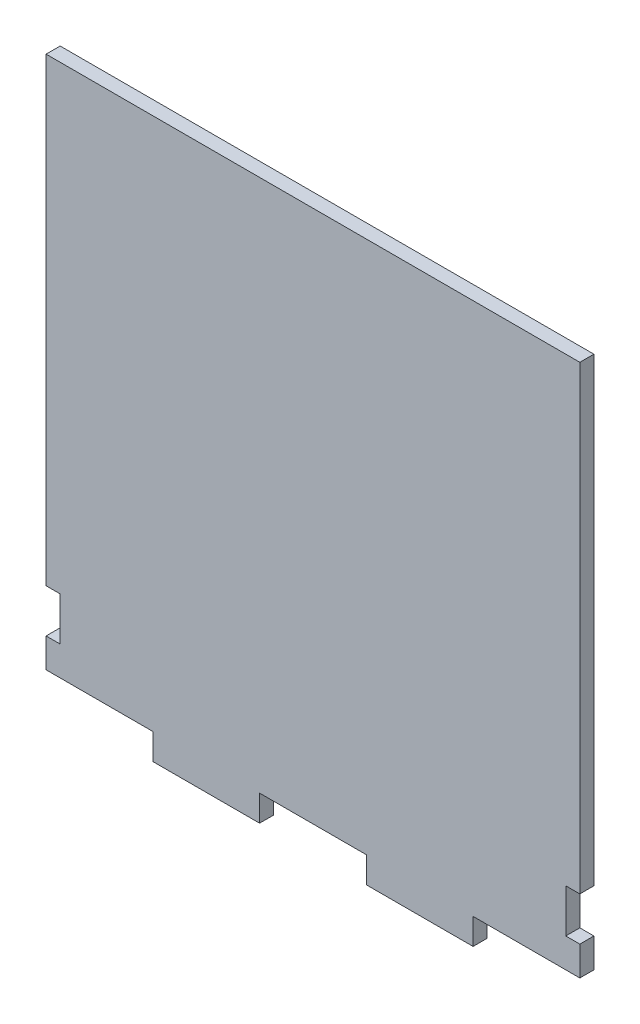
ISO-10303-21;
HEADER;
FILE_DESCRIPTION(('STEP AP214'),'2;1');
FILE_NAME('part.step','',(''),(''),'','','');
FILE_SCHEMA(('AUTOMOTIVE_DESIGN { 1 0 10303 214 1 1 1 1 }'));
ENDSEC;
DATA;
#1=APPLICATION_CONTEXT('core data for automotive mechanical design processes');
#2=APPLICATION_PROTOCOL_DEFINITION('international standard','automotive_design',2000,#1);
#3=PRODUCT_CONTEXT('',#1,'mechanical');
#4=PRODUCT('Part','Part','',(#3));
#5=PRODUCT_RELATED_PRODUCT_CATEGORY('part','',(#4));
#6=PRODUCT_DEFINITION_FORMATION('','',#4);
#7=PRODUCT_DEFINITION_CONTEXT('part definition',#1,'design');
#8=PRODUCT_DEFINITION('design','',#6,#7);
#9=PRODUCT_DEFINITION_SHAPE('','',#8);
#10=(LENGTH_UNIT() NAMED_UNIT(*) SI_UNIT(.MILLI.,.METRE.));
#11=(NAMED_UNIT(*) PLANE_ANGLE_UNIT() SI_UNIT($,.RADIAN.));
#12=(NAMED_UNIT(*) SI_UNIT($,.STERADIAN.) SOLID_ANGLE_UNIT());
#13=UNCERTAINTY_MEASURE_WITH_UNIT(LENGTH_MEASURE(1.E-05),#10,'distance_accuracy_value','');
#14=(GEOMETRIC_REPRESENTATION_CONTEXT(3) GLOBAL_UNCERTAINTY_ASSIGNED_CONTEXT((#13)) GLOBAL_UNIT_ASSIGNED_CONTEXT((#10,
#11,#12)) REPRESENTATION_CONTEXT('',''));
#15=CARTESIAN_POINT('',(0.,0.,0.));
#16=DIRECTION('',(0.,0.,1.));
#17=DIRECTION('',(1.,0.,0.));
#18=AXIS2_PLACEMENT_3D('',#15,#16,#17);
#19=CARTESIAN_POINT('',(10.24,-14.8,2.7));
#20=DIRECTION('',(0.,1.,0.));
#21=DIRECTION('',(0.,0.,1.));
#22=AXIS2_PLACEMENT_3D('',#19,#20,#21);
#23=PLANE('',#22);
#24=DIRECTION('',(1.,0.,0.));
#25=VECTOR('',#24,1.);
#26=CARTESIAN_POINT('',(10.24,-14.8,0.));
#27=LINE('',#26,#25);
#28=CARTESIAN_POINT('',(10.24,-14.8,0.));
#29=VERTEX_POINT('',#28);
#30=CARTESIAN_POINT('',(30.72,-14.8,0.));
#31=VERTEX_POINT('',#30);
#32=EDGE_CURVE('E201',#29,#31,#27,.T.);
#33=ORIENTED_EDGE('',*,*,#32,.T.);
#34=DIRECTION('',(0.,0.,-1.));
#35=VECTOR('',#34,1.);
#36=CARTESIAN_POINT('',(30.72,-14.8,2.7));
#37=LINE('',#36,#35);
#38=CARTESIAN_POINT('',(30.72,-14.8,2.7));
#39=VERTEX_POINT('',#38);
#40=EDGE_CURVE('E11',#39,#31,#37,.T.);
#41=ORIENTED_EDGE('',*,*,#40,.F.);
#42=DIRECTION('',(1.,0.,0.));
#43=VECTOR('',#42,1.);
#44=CARTESIAN_POINT('',(10.24,-14.8,2.7));
#45=LINE('',#44,#43);
#46=CARTESIAN_POINT('',(10.24,-14.8,2.7));
#47=VERTEX_POINT('',#46);
#48=EDGE_CURVE('E242',#47,#39,#45,.T.);
#49=ORIENTED_EDGE('',*,*,#48,.F.);
#50=DIRECTION('',(0.,0.,-1.));
#51=VECTOR('',#50,1.);
#52=CARTESIAN_POINT('',(10.24,-14.8,2.7));
#53=LINE('',#52,#51);
#54=EDGE_CURVE('E197',#47,#29,#53,.T.);
#55=ORIENTED_EDGE('',*,*,#54,.T.);
#56=EDGE_LOOP('',(#33,#41,#49,#55));
#57=FACE_BOUND('',#56,.T.);
#58=ADVANCED_FACE('F33',(#57),#23,.F.);
#59=CARTESIAN_POINT('',(30.72,-12.5,2.7));
#60=DIRECTION('',(-1.,0.,0.));
#61=DIRECTION('',(0.,0.,1.));
#62=AXIS2_PLACEMENT_3D('',#59,#60,#61);
#63=PLANE('',#62);
#64=DIRECTION('',(0.,1.,0.));
#65=VECTOR('',#64,1.);
#66=CARTESIAN_POINT('',(30.72,-12.5,0.));
#67=LINE('',#66,#65);
#68=CARTESIAN_POINT('',(30.72,-9.80000000000001,0.));
#69=VERTEX_POINT('',#68);
#70=EDGE_CURVE('E204',#31,#69,#67,.T.);
#71=ORIENTED_EDGE('',*,*,#70,.T.);
#72=DIRECTION('',(0.,0.,-1.));
#73=VECTOR('',#72,1.);
#74=CARTESIAN_POINT('',(30.72,-9.80000000000001,2.7));
#75=LINE('',#74,#73);
#76=CARTESIAN_POINT('',(30.72,-9.80000000000001,2.7));
#77=VERTEX_POINT('',#76);
#78=EDGE_CURVE('E41',#77,#69,#75,.T.);
#79=ORIENTED_EDGE('',*,*,#78,.F.);
#80=DIRECTION('',(0.,1.,0.));
#81=VECTOR('',#80,1.);
#82=CARTESIAN_POINT('',(30.72,-14.8,2.7));
#83=LINE('',#82,#81);
#84=EDGE_CURVE('E126',#39,#77,#83,.T.);
#85=ORIENTED_EDGE('',*,*,#84,.F.);
#86=ORIENTED_EDGE('',*,*,#40,.T.);
#87=EDGE_LOOP('',(#71,#79,#85,#86));
#88=FACE_BOUND('',#87,.T.);
#89=ADVANCED_FACE('F350',(#88),#63,.F.);
#90=CARTESIAN_POINT('',(51.2,-9.80000000000001,2.7));
#91=DIRECTION('',(0.,1.,0.));
#92=DIRECTION('',(0.,0.,1.));
#93=AXIS2_PLACEMENT_3D('',#90,#91,#92);
#94=PLANE('',#93);
#95=DIRECTION('',(1.,0.,0.));
#96=VECTOR('',#95,1.);
#97=CARTESIAN_POINT('',(51.2,-9.80000000000001,0.));
#98=LINE('',#97,#96);
#99=CARTESIAN_POINT('',(51.2,-9.80000000000001,0.));
#100=VERTEX_POINT('',#99);
#101=EDGE_CURVE('E206',#69,#100,#98,.T.);
#102=ORIENTED_EDGE('',*,*,#101,.T.);
#103=DIRECTION('',(0.,0.,-1.));
#104=VECTOR('',#103,1.);
#105=CARTESIAN_POINT('',(51.2,-9.80000000000001,2.7));
#106=LINE('',#105,#104);
#107=CARTESIAN_POINT('',(51.2,-9.80000000000001,2.7));
#108=VERTEX_POINT('',#107);
#109=EDGE_CURVE('E285',#108,#100,#106,.T.);
#110=ORIENTED_EDGE('',*,*,#109,.F.);
#111=DIRECTION('',(1.,0.,0.));
#112=VECTOR('',#111,1.);
#113=CARTESIAN_POINT('',(51.2,-9.80000000000001,2.7));
#114=LINE('',#113,#112);
#115=EDGE_CURVE('E293',#77,#108,#114,.T.);
#116=ORIENTED_EDGE('',*,*,#115,.F.);
#117=ORIENTED_EDGE('',*,*,#78,.T.);
#118=EDGE_LOOP('',(#102,#110,#116,#117));
#119=FACE_BOUND('',#118,.T.);
#120=ADVANCED_FACE('F291',(#119),#94,.F.);
#121=CARTESIAN_POINT('',(51.2,-4.1666666666667,2.7));
#122=DIRECTION('',(-1.,0.,0.));
#123=DIRECTION('',(0.,-1.,0.));
#124=AXIS2_PLACEMENT_3D('',#121,#122,#123);
#125=PLANE('',#124);
#126=DIRECTION('',(0.,1.,0.));
#127=VECTOR('',#126,1.);
#128=CARTESIAN_POINT('',(51.2,-4.1666666666667,0.));
#129=LINE('',#128,#127);
#130=CARTESIAN_POINT('',(51.2,-4.1666666666667,0.));
#131=VERTEX_POINT('',#130);
#132=EDGE_CURVE('E208',#100,#131,#129,.T.);
#133=ORIENTED_EDGE('',*,*,#132,.T.);
#134=DIRECTION('',(0.,0.,-1.));
#135=VECTOR('',#134,1.);
#136=CARTESIAN_POINT('',(51.2,-4.1666666666667,2.7));
#137=LINE('',#136,#135);
#138=CARTESIAN_POINT('',(51.2,-4.1666666666667,2.7));
#139=VERTEX_POINT('',#138);
#140=EDGE_CURVE('E282',#139,#131,#137,.T.);
#141=ORIENTED_EDGE('',*,*,#140,.F.);
#142=DIRECTION('',(0.,1.,0.));
#143=VECTOR('',#142,1.);
#144=CARTESIAN_POINT('',(51.2,-4.1666666666667,2.7));
#145=LINE('',#144,#143);
#146=EDGE_CURVE('E309',#108,#139,#145,.T.);
#147=ORIENTED_EDGE('',*,*,#146,.F.);
#148=ORIENTED_EDGE('',*,*,#109,.T.);
#149=EDGE_LOOP('',(#133,#141,#147,#148));
#150=FACE_BOUND('',#149,.T.);
#151=ADVANCED_FACE('F300',(#150),#125,.F.);
#152=CARTESIAN_POINT('',(51.2,-4.1666666666667,2.7));
#153=DIRECTION('',(0.,-1.,0.));
#154=DIRECTION('',(1.,0.,0.));
#155=AXIS2_PLACEMENT_3D('',#152,#153,#154);
#156=PLANE('',#155);
#157=DIRECTION('',(-1.,0.,0.));
#158=VECTOR('',#157,1.);
#159=CARTESIAN_POINT('',(51.2,-4.1666666666667,0.));
#160=LINE('',#159,#158);
#161=CARTESIAN_POINT('',(48.5,-4.1666666666667,0.));
#162=VERTEX_POINT('',#161);
#163=EDGE_CURVE('E210',#131,#162,#160,.T.);
#164=ORIENTED_EDGE('',*,*,#163,.T.);
#165=DIRECTION('',(0.,0.,-1.));
#166=VECTOR('',#165,1.);
#167=CARTESIAN_POINT('',(48.5,-4.1666666666667,2.7));
#168=LINE('',#167,#166);
#169=CARTESIAN_POINT('',(48.5,-4.1666666666667,2.7));
#170=VERTEX_POINT('',#169);
#171=EDGE_CURVE('E279',#170,#162,#168,.T.);
#172=ORIENTED_EDGE('',*,*,#171,.F.);
#173=DIRECTION('',(-1.,0.,0.));
#174=VECTOR('',#173,1.);
#175=CARTESIAN_POINT('',(51.2,-4.1666666666667,2.7));
#176=LINE('',#175,#174);
#177=EDGE_CURVE('E306',#139,#170,#176,.T.);
#178=ORIENTED_EDGE('',*,*,#177,.F.);
#179=ORIENTED_EDGE('',*,*,#140,.T.);
#180=EDGE_LOOP('',(#164,#172,#178,#179));
#181=FACE_BOUND('',#180,.T.);
#182=ADVANCED_FACE('F304',(#181),#156,.F.);
#183=CARTESIAN_POINT('',(48.5,4.16666666666663,2.7));
#184=DIRECTION('',(-1.,0.,0.));
#185=DIRECTION('',(0.,0.,1.));
#186=AXIS2_PLACEMENT_3D('',#183,#184,#185);
#187=PLANE('',#186);
#188=DIRECTION('',(0.,1.,0.));
#189=VECTOR('',#188,1.);
#190=CARTESIAN_POINT('',(48.5,4.16666666666663,0.));
#191=LINE('',#190,#189);
#192=CARTESIAN_POINT('',(48.5,4.16666666666663,0.));
#193=VERTEX_POINT('',#192);
#194=EDGE_CURVE('E212',#162,#193,#191,.T.);
#195=ORIENTED_EDGE('',*,*,#194,.T.);
#196=DIRECTION('',(0.,0.,-1.));
#197=VECTOR('',#196,1.);
#198=CARTESIAN_POINT('',(48.5,4.16666666666663,2.7));
#199=LINE('',#198,#197);
#200=CARTESIAN_POINT('',(48.5,4.16666666666663,2.7));
#201=VERTEX_POINT('',#200);
#202=EDGE_CURVE('E276',#201,#193,#199,.T.);
#203=ORIENTED_EDGE('',*,*,#202,.F.);
#204=DIRECTION('',(0.,1.,0.));
#205=VECTOR('',#204,1.);
#206=CARTESIAN_POINT('',(48.5,4.16666666666663,2.7));
#207=LINE('',#206,#205);
#208=EDGE_CURVE('E308',#170,#201,#207,.T.);
#209=ORIENTED_EDGE('',*,*,#208,.F.);
#210=ORIENTED_EDGE('',*,*,#171,.T.);
#211=EDGE_LOOP('',(#195,#203,#209,#210));
#212=FACE_BOUND('',#211,.T.);
#213=ADVANCED_FACE('F362',(#212),#187,.F.);
#214=CARTESIAN_POINT('',(51.2,4.16666666666663,2.7));
#215=DIRECTION('',(0.,1.,0.));
#216=DIRECTION('',(0.,0.,1.));
#217=AXIS2_PLACEMENT_3D('',#214,#215,#216);
#218=PLANE('',#217);
#219=DIRECTION('',(1.,0.,0.));
#220=VECTOR('',#219,1.);
#221=CARTESIAN_POINT('',(51.2,4.16666666666663,0.));
#222=LINE('',#221,#220);
#223=CARTESIAN_POINT('',(51.2,4.16666666666663,0.));
#224=VERTEX_POINT('',#223);
#225=EDGE_CURVE('E214',#193,#224,#222,.T.);
#226=ORIENTED_EDGE('',*,*,#225,.T.);
#227=DIRECTION('',(0.,0.,-1.));
#228=VECTOR('',#227,1.);
#229=CARTESIAN_POINT('',(51.2,4.16666666666663,2.7));
#230=LINE('',#229,#228);
#231=CARTESIAN_POINT('',(51.2,4.16666666666663,2.7));
#232=VERTEX_POINT('',#231);
#233=EDGE_CURVE('E273',#232,#224,#230,.T.);
#234=ORIENTED_EDGE('',*,*,#233,.F.);
#235=DIRECTION('',(1.,0.,0.));
#236=VECTOR('',#235,1.);
#237=CARTESIAN_POINT('',(51.2,4.16666666666663,2.7));
#238=LINE('',#237,#236);
#239=EDGE_CURVE('E311',#201,#232,#238,.T.);
#240=ORIENTED_EDGE('',*,*,#239,.F.);
#241=ORIENTED_EDGE('',*,*,#202,.T.);
#242=EDGE_LOOP('',(#226,#234,#240,#241));
#243=FACE_BOUND('',#242,.T.);
#244=ADVANCED_FACE('F365',(#243),#218,.F.);
#245=CARTESIAN_POINT('',(51.2,4.16666666666663,2.7));
#246=DIRECTION('',(-1.,0.,0.));
#247=DIRECTION('',(0.,-1.,0.));
#248=AXIS2_PLACEMENT_3D('',#245,#246,#247);
#249=PLANE('',#248);
#250=DIRECTION('',(0.,1.,0.));
#251=VECTOR('',#250,1.);
#252=CARTESIAN_POINT('',(51.2,4.16666666666663,0.));
#253=LINE('',#252,#251);
#254=CARTESIAN_POINT('',(51.2,92.5,0.));
#255=VERTEX_POINT('',#254);
#256=EDGE_CURVE('E216',#224,#255,#253,.T.);
#257=ORIENTED_EDGE('',*,*,#256,.T.);
#258=DIRECTION('',(0.,0.,-1.));
#259=VECTOR('',#258,1.);
#260=CARTESIAN_POINT('',(51.2,92.5,2.7));
#261=LINE('',#260,#259);
#262=CARTESIAN_POINT('',(51.2,92.5,2.7));
#263=VERTEX_POINT('',#262);
#264=EDGE_CURVE('E270',#263,#255,#261,.T.);
#265=ORIENTED_EDGE('',*,*,#264,.F.);
#266=DIRECTION('',(0.,1.,0.));
#267=VECTOR('',#266,1.);
#268=CARTESIAN_POINT('',(51.2,4.16666666666663,2.7));
#269=LINE('',#268,#267);
#270=EDGE_CURVE('E317',#232,#263,#269,.T.);
#271=ORIENTED_EDGE('',*,*,#270,.F.);
#272=ORIENTED_EDGE('',*,*,#233,.T.);
#273=EDGE_LOOP('',(#257,#265,#271,#272));
#274=FACE_BOUND('',#273,.T.);
#275=ADVANCED_FACE('F369',(#274),#249,.F.);
#276=CARTESIAN_POINT('',(-51.2,92.5,2.7));
#277=DIRECTION('',(0.,-1.,0.));
#278=DIRECTION('',(0.,0.,-1.));
#279=AXIS2_PLACEMENT_3D('',#276,#277,#278);
#280=PLANE('',#279);
#281=DIRECTION('',(-1.,0.,0.));
#282=VECTOR('',#281,1.);
#283=CARTESIAN_POINT('',(-51.2,92.5,0.));
#284=LINE('',#283,#282);
#285=CARTESIAN_POINT('',(-51.2,92.5,0.));
#286=VERTEX_POINT('',#285);
#287=EDGE_CURVE('E218',#255,#286,#284,.T.);
#288=ORIENTED_EDGE('',*,*,#287,.T.);
#289=DIRECTION('',(0.,0.,-1.));
#290=VECTOR('',#289,1.);
#291=CARTESIAN_POINT('',(-51.2,92.5,2.7));
#292=LINE('',#291,#290);
#293=CARTESIAN_POINT('',(-51.2,92.5,2.7));
#294=VERTEX_POINT('',#293);
#295=EDGE_CURVE('E267',#294,#286,#292,.T.);
#296=ORIENTED_EDGE('',*,*,#295,.F.);
#297=DIRECTION('',(-1.,0.,0.));
#298=VECTOR('',#297,1.);
#299=CARTESIAN_POINT('',(-51.2,92.5,2.7));
#300=LINE('',#299,#298);
#301=EDGE_CURVE('E319',#263,#294,#300,.T.);
#302=ORIENTED_EDGE('',*,*,#301,.F.);
#303=ORIENTED_EDGE('',*,*,#264,.T.);
#304=EDGE_LOOP('',(#288,#296,#302,#303));
#305=FACE_BOUND('',#304,.T.);
#306=ADVANCED_FACE('F373',(#305),#280,.F.);
#307=CARTESIAN_POINT('',(-51.2,92.5,2.7));
#308=DIRECTION('',(1.,0.,0.));
#309=DIRECTION('',(0.,0.,-1.));
#310=AXIS2_PLACEMENT_3D('',#307,#308,#309);
#311=PLANE('',#310);
#312=DIRECTION('',(0.,-1.,0.));
#313=VECTOR('',#312,1.);
#314=CARTESIAN_POINT('',(-51.2,92.5,0.));
#315=LINE('',#314,#313);
#316=CARTESIAN_POINT('',(-51.2,4.16666666666666,0.));
#317=VERTEX_POINT('',#316);
#318=EDGE_CURVE('E220',#286,#317,#315,.T.);
#319=ORIENTED_EDGE('',*,*,#318,.T.);
#320=DIRECTION('',(0.,0.,-1.));
#321=VECTOR('',#320,1.);
#322=CARTESIAN_POINT('',(-51.2,4.16666666666666,2.7));
#323=LINE('',#322,#321);
#324=CARTESIAN_POINT('',(-51.2,4.16666666666666,2.7));
#325=VERTEX_POINT('',#324);
#326=EDGE_CURVE('E264',#325,#317,#323,.T.);
#327=ORIENTED_EDGE('',*,*,#326,.F.);
#328=DIRECTION('',(0.,-1.,0.));
#329=VECTOR('',#328,1.);
#330=CARTESIAN_POINT('',(-51.2,92.5,2.7));
#331=LINE('',#330,#329);
#332=EDGE_CURVE('E321',#294,#325,#331,.T.);
#333=ORIENTED_EDGE('',*,*,#332,.F.);
#334=ORIENTED_EDGE('',*,*,#295,.T.);
#335=EDGE_LOOP('',(#319,#327,#333,#334));
#336=FACE_BOUND('',#335,.T.);
#337=ADVANCED_FACE('F377',(#336),#311,.F.);
#338=CARTESIAN_POINT('',(-51.2,4.16666666666666,2.7));
#339=DIRECTION('',(0.,1.,0.));
#340=DIRECTION('',(0.,0.,1.));
#341=AXIS2_PLACEMENT_3D('',#338,#339,#340);
#342=PLANE('',#341);
#343=DIRECTION('',(1.,0.,0.));
#344=VECTOR('',#343,1.);
#345=CARTESIAN_POINT('',(-51.2,4.16666666666666,0.));
#346=LINE('',#345,#344);
#347=CARTESIAN_POINT('',(-48.5,4.16666666666666,0.));
#348=VERTEX_POINT('',#347);
#349=EDGE_CURVE('E222',#317,#348,#346,.T.);
#350=ORIENTED_EDGE('',*,*,#349,.T.);
#351=DIRECTION('',(0.,0.,-1.));
#352=VECTOR('',#351,1.);
#353=CARTESIAN_POINT('',(-48.5,4.16666666666666,2.7));
#354=LINE('',#353,#352);
#355=CARTESIAN_POINT('',(-48.5,4.16666666666666,2.7));
#356=VERTEX_POINT('',#355);
#357=EDGE_CURVE('E261',#356,#348,#354,.T.);
#358=ORIENTED_EDGE('',*,*,#357,.F.);
#359=DIRECTION('',(1.,0.,0.));
#360=VECTOR('',#359,1.);
#361=CARTESIAN_POINT('',(-51.2,4.16666666666666,2.7));
#362=LINE('',#361,#360);
#363=EDGE_CURVE('E323',#325,#356,#362,.T.);
#364=ORIENTED_EDGE('',*,*,#363,.F.);
#365=ORIENTED_EDGE('',*,*,#326,.T.);
#366=EDGE_LOOP('',(#350,#358,#364,#365));
#367=FACE_BOUND('',#366,.T.);
#368=ADVANCED_FACE('F381',(#367),#342,.F.);
#369=CARTESIAN_POINT('',(-48.5,4.16666666666666,2.7));
#370=DIRECTION('',(1.,0.,0.));
#371=DIRECTION('',(0.,0.,-1.));
#372=AXIS2_PLACEMENT_3D('',#369,#370,#371);
#373=PLANE('',#372);
#374=DIRECTION('',(0.,-1.,0.));
#375=VECTOR('',#374,1.);
#376=CARTESIAN_POINT('',(-48.5,4.16666666666666,0.));
#377=LINE('',#376,#375);
#378=CARTESIAN_POINT('',(-48.5,-4.16666666666667,0.));
#379=VERTEX_POINT('',#378);
#380=EDGE_CURVE('E224',#348,#379,#377,.T.);
#381=ORIENTED_EDGE('',*,*,#380,.T.);
#382=DIRECTION('',(0.,0.,-1.));
#383=VECTOR('',#382,1.);
#384=CARTESIAN_POINT('',(-48.5,-4.16666666666667,2.7));
#385=LINE('',#384,#383);
#386=CARTESIAN_POINT('',(-48.5,-4.16666666666667,2.7));
#387=VERTEX_POINT('',#386);
#388=EDGE_CURVE('E258',#387,#379,#385,.T.);
#389=ORIENTED_EDGE('',*,*,#388,.F.);
#390=DIRECTION('',(0.,-1.,0.));
#391=VECTOR('',#390,1.);
#392=CARTESIAN_POINT('',(-48.5,4.16666666666666,2.7));
#393=LINE('',#392,#391);
#394=EDGE_CURVE('E325',#356,#387,#393,.T.);
#395=ORIENTED_EDGE('',*,*,#394,.F.);
#396=ORIENTED_EDGE('',*,*,#357,.T.);
#397=EDGE_LOOP('',(#381,#389,#395,#396));
#398=FACE_BOUND('',#397,.T.);
#399=ADVANCED_FACE('F385',(#398),#373,.F.);
#400=CARTESIAN_POINT('',(-51.2,-4.16666666666668,2.7));
#401=DIRECTION('',(0.,-1.,0.));
#402=DIRECTION('',(1.,0.,0.));
#403=AXIS2_PLACEMENT_3D('',#400,#401,#402);
#404=PLANE('',#403);
#405=DIRECTION('',(-1.,0.,0.));
#406=VECTOR('',#405,1.);
#407=CARTESIAN_POINT('',(-51.2,-4.16666666666668,0.));
#408=LINE('',#407,#406);
#409=CARTESIAN_POINT('',(-51.2,-4.16666666666668,0.));
#410=VERTEX_POINT('',#409);
#411=EDGE_CURVE('E226',#379,#410,#408,.T.);
#412=ORIENTED_EDGE('',*,*,#411,.T.);
#413=DIRECTION('',(0.,0.,-1.));
#414=VECTOR('',#413,1.);
#415=CARTESIAN_POINT('',(-51.2,-4.16666666666668,2.7));
#416=LINE('',#415,#414);
#417=CARTESIAN_POINT('',(-51.2,-4.16666666666668,2.7));
#418=VERTEX_POINT('',#417);
#419=EDGE_CURVE('E255',#418,#410,#416,.T.);
#420=ORIENTED_EDGE('',*,*,#419,.F.);
#421=DIRECTION('',(-1.,0.,0.));
#422=VECTOR('',#421,1.);
#423=CARTESIAN_POINT('',(-51.2,-4.16666666666668,2.7));
#424=LINE('',#423,#422);
#425=EDGE_CURVE('E327',#387,#418,#424,.T.);
#426=ORIENTED_EDGE('',*,*,#425,.F.);
#427=ORIENTED_EDGE('',*,*,#388,.T.);
#428=EDGE_LOOP('',(#412,#420,#426,#427));
#429=FACE_BOUND('',#428,.T.);
#430=ADVANCED_FACE('F389',(#429),#404,.F.);
#431=CARTESIAN_POINT('',(-51.2,-9.80000000000001,2.7));
#432=DIRECTION('',(1.,0.,0.));
#433=DIRECTION('',(0.,0.,-1.));
#434=AXIS2_PLACEMENT_3D('',#431,#432,#433);
#435=PLANE('',#434);
#436=DIRECTION('',(0.,-1.,0.));
#437=VECTOR('',#436,1.);
#438=CARTESIAN_POINT('',(-51.2,-9.80000000000001,0.));
#439=LINE('',#438,#437);
#440=CARTESIAN_POINT('',(-51.2,-9.80000000000001,0.));
#441=VERTEX_POINT('',#440);
#442=EDGE_CURVE('E228',#410,#441,#439,.T.);
#443=ORIENTED_EDGE('',*,*,#442,.T.);
#444=DIRECTION('',(0.,0.,-1.));
#445=VECTOR('',#444,1.);
#446=CARTESIAN_POINT('',(-51.2,-9.80000000000001,2.7));
#447=LINE('',#446,#445);
#448=CARTESIAN_POINT('',(-51.2,-9.80000000000001,2.7));
#449=VERTEX_POINT('',#448);
#450=EDGE_CURVE('E252',#449,#441,#447,.T.);
#451=ORIENTED_EDGE('',*,*,#450,.F.);
#452=DIRECTION('',(0.,-1.,0.));
#453=VECTOR('',#452,1.);
#454=CARTESIAN_POINT('',(-51.2,-9.80000000000001,2.7));
#455=LINE('',#454,#453);
#456=EDGE_CURVE('E329',#418,#449,#455,.T.);
#457=ORIENTED_EDGE('',*,*,#456,.F.);
#458=ORIENTED_EDGE('',*,*,#419,.T.);
#459=EDGE_LOOP('',(#443,#451,#457,#458));
#460=FACE_BOUND('',#459,.T.);
#461=ADVANCED_FACE('F393',(#460),#435,.F.);
#462=CARTESIAN_POINT('',(-30.72,-9.80000000000001,2.7));
#463=DIRECTION('',(0.,1.,0.));
#464=DIRECTION('',(0.,0.,1.));
#465=AXIS2_PLACEMENT_3D('',#462,#463,#464);
#466=PLANE('',#465);
#467=DIRECTION('',(1.,0.,0.));
#468=VECTOR('',#467,1.);
#469=CARTESIAN_POINT('',(-30.72,-9.80000000000001,0.));
#470=LINE('',#469,#468);
#471=CARTESIAN_POINT('',(-30.72,-9.80000000000001,0.));
#472=VERTEX_POINT('',#471);
#473=EDGE_CURVE('E230',#441,#472,#470,.T.);
#474=ORIENTED_EDGE('',*,*,#473,.T.);
#475=DIRECTION('',(0.,0.,-1.));
#476=VECTOR('',#475,1.);
#477=CARTESIAN_POINT('',(-30.72,-9.80000000000001,2.7));
#478=LINE('',#477,#476);
#479=CARTESIAN_POINT('',(-30.72,-9.80000000000001,2.7));
#480=VERTEX_POINT('',#479);
#481=EDGE_CURVE('E249',#480,#472,#478,.T.);
#482=ORIENTED_EDGE('',*,*,#481,.F.);
#483=DIRECTION('',(1.,0.,0.));
#484=VECTOR('',#483,1.);
#485=CARTESIAN_POINT('',(-30.72,-9.80000000000001,2.7));
#486=LINE('',#485,#484);
#487=EDGE_CURVE('E331',#449,#480,#486,.T.);
#488=ORIENTED_EDGE('',*,*,#487,.F.);
#489=ORIENTED_EDGE('',*,*,#450,.T.);
#490=EDGE_LOOP('',(#474,#482,#488,#489));
#491=FACE_BOUND('',#490,.T.);
#492=ADVANCED_FACE('F397',(#491),#466,.F.);
#493=CARTESIAN_POINT('',(-30.72,-12.5,2.7));
#494=DIRECTION('',(1.,0.,0.));
#495=DIRECTION('',(0.,0.,-1.));
#496=AXIS2_PLACEMENT_3D('',#493,#494,#495);
#497=PLANE('',#496);
#498=DIRECTION('',(0.,-1.,0.));
#499=VECTOR('',#498,1.);
#500=CARTESIAN_POINT('',(-30.72,-12.5,0.));
#501=LINE('',#500,#499);
#502=CARTESIAN_POINT('',(-30.72,-14.8,0.));
#503=VERTEX_POINT('',#502);
#504=EDGE_CURVE('E233',#472,#503,#501,.T.);
#505=ORIENTED_EDGE('',*,*,#504,.T.);
#506=DIRECTION('',(0.,0.,-1.));
#507=VECTOR('',#506,1.);
#508=CARTESIAN_POINT('',(-30.72,-14.8,2.7));
#509=LINE('',#508,#507);
#510=CARTESIAN_POINT('',(-30.72,-14.8,2.7));
#511=VERTEX_POINT('',#510);
#512=EDGE_CURVE('E246',#511,#503,#509,.T.);
#513=ORIENTED_EDGE('',*,*,#512,.F.);
#514=DIRECTION('',(0.,-1.,0.));
#515=VECTOR('',#514,1.);
#516=CARTESIAN_POINT('',(-30.72,-12.5,2.7));
#517=LINE('',#516,#515);
#518=EDGE_CURVE('E333',#480,#511,#517,.T.);
#519=ORIENTED_EDGE('',*,*,#518,.F.);
#520=ORIENTED_EDGE('',*,*,#481,.T.);
#521=EDGE_LOOP('',(#505,#513,#519,#520));
#522=FACE_BOUND('',#521,.T.);
#523=ADVANCED_FACE('F339',(#522),#497,.F.);
#524=CARTESIAN_POINT('',(-30.72,-14.8,2.7));
#525=DIRECTION('',(0.,1.,0.));
#526=DIRECTION('',(0.,0.,1.));
#527=AXIS2_PLACEMENT_3D('',#524,#525,#526);
#528=PLANE('',#527);
#529=DIRECTION('',(1.,0.,0.));
#530=VECTOR('',#529,1.);
#531=CARTESIAN_POINT('',(-30.72,-14.8,0.));
#532=LINE('',#531,#530);
#533=CARTESIAN_POINT('',(-10.24,-14.8,0.));
#534=VERTEX_POINT('',#533);
#535=EDGE_CURVE('E235',#503,#534,#532,.T.);
#536=ORIENTED_EDGE('',*,*,#535,.T.);
#537=DIRECTION('',(0.,0.,-1.));
#538=VECTOR('',#537,1.);
#539=CARTESIAN_POINT('',(-10.24,-14.8,2.7));
#540=LINE('',#539,#538);
#541=CARTESIAN_POINT('',(-10.24,-14.8,2.7));
#542=VERTEX_POINT('',#541);
#543=EDGE_CURVE('E192',#542,#534,#540,.T.);
#544=ORIENTED_EDGE('',*,*,#543,.F.);
#545=DIRECTION('',(1.,0.,0.));
#546=VECTOR('',#545,1.);
#547=CARTESIAN_POINT('',(-30.72,-14.8,2.7));
#548=LINE('',#547,#546);
#549=EDGE_CURVE('E182',#511,#542,#548,.T.);
#550=ORIENTED_EDGE('',*,*,#549,.F.);
#551=ORIENTED_EDGE('',*,*,#512,.T.);
#552=EDGE_LOOP('',(#536,#544,#550,#551));
#553=FACE_BOUND('',#552,.T.);
#554=ADVANCED_FACE('F342',(#553),#528,.F.);
#555=CARTESIAN_POINT('',(-10.24,-12.5,2.7));
#556=DIRECTION('',(-1.,0.,0.));
#557=DIRECTION('',(0.,0.,1.));
#558=AXIS2_PLACEMENT_3D('',#555,#556,#557);
#559=PLANE('',#558);
#560=DIRECTION('',(0.,1.,0.));
#561=VECTOR('',#560,1.);
#562=CARTESIAN_POINT('',(-10.24,-12.5,0.));
#563=LINE('',#562,#561);
#564=CARTESIAN_POINT('',(-10.24,-9.80000000000001,0.));
#565=VERTEX_POINT('',#564);
#566=EDGE_CURVE('E190',#534,#565,#563,.T.);
#567=ORIENTED_EDGE('',*,*,#566,.T.);
#568=DIRECTION('',(0.,0.,-1.));
#569=VECTOR('',#568,1.);
#570=CARTESIAN_POINT('',(-10.24,-9.80000000000001,2.7));
#571=LINE('',#570,#569);
#572=CARTESIAN_POINT('',(-10.24,-9.80000000000001,2.7));
#573=VERTEX_POINT('',#572);
#574=EDGE_CURVE('E188',#573,#565,#571,.T.);
#575=ORIENTED_EDGE('',*,*,#574,.F.);
#576=DIRECTION('',(0.,1.,0.));
#577=VECTOR('',#576,1.);
#578=CARTESIAN_POINT('',(-10.24,-12.5,2.7));
#579=LINE('',#578,#577);
#580=EDGE_CURVE('E175',#542,#573,#579,.T.);
#581=ORIENTED_EDGE('',*,*,#580,.F.);
#582=ORIENTED_EDGE('',*,*,#543,.T.);
#583=EDGE_LOOP('',(#567,#575,#581,#582));
#584=FACE_BOUND('',#583,.T.);
#585=ADVANCED_FACE('F189',(#584),#559,.F.);
#586=CARTESIAN_POINT('',(10.24,-9.80000000000001,2.7));
#587=DIRECTION('',(0.,1.,0.));
#588=DIRECTION('',(0.,0.,1.));
#589=AXIS2_PLACEMENT_3D('',#586,#587,#588);
#590=PLANE('',#589);
#591=DIRECTION('',(1.,0.,0.));
#592=VECTOR('',#591,1.);
#593=CARTESIAN_POINT('',(10.24,-9.80000000000001,0.));
#594=LINE('',#593,#592);
#595=CARTESIAN_POINT('',(10.24,-9.80000000000001,0.));
#596=VERTEX_POINT('',#595);
#597=EDGE_CURVE('E239',#565,#596,#594,.T.);
#598=ORIENTED_EDGE('',*,*,#597,.T.);
#599=DIRECTION('',(0.,0.,-1.));
#600=VECTOR('',#599,1.);
#601=CARTESIAN_POINT('',(10.24,-9.80000000000001,2.7));
#602=LINE('',#601,#600);
#603=CARTESIAN_POINT('',(10.24,-9.80000000000001,2.7));
#604=VERTEX_POINT('',#603);
#605=EDGE_CURVE('E193',#604,#596,#602,.T.);
#606=ORIENTED_EDGE('',*,*,#605,.F.);
#607=DIRECTION('',(1.,0.,0.));
#608=VECTOR('',#607,1.);
#609=CARTESIAN_POINT('',(10.24,-9.80000000000001,2.7));
#610=LINE('',#609,#608);
#611=EDGE_CURVE('E179',#573,#604,#610,.T.);
#612=ORIENTED_EDGE('',*,*,#611,.F.);
#613=ORIENTED_EDGE('',*,*,#574,.T.);
#614=EDGE_LOOP('',(#598,#606,#612,#613));
#615=FACE_BOUND('',#614,.T.);
#616=ADVANCED_FACE('F195',(#615),#590,.F.);
#617=CARTESIAN_POINT('',(10.24,-12.5,2.7));
#618=DIRECTION('',(1.,0.,0.));
#619=DIRECTION('',(0.,1.,0.));
#620=AXIS2_PLACEMENT_3D('',#617,#618,#619);
#621=PLANE('',#620);
#622=DIRECTION('',(0.,-1.,0.));
#623=VECTOR('',#622,1.);
#624=CARTESIAN_POINT('',(10.24,-12.5,0.));
#625=LINE('',#624,#623);
#626=EDGE_CURVE('E114',#596,#29,#625,.T.);
#627=ORIENTED_EDGE('',*,*,#626,.T.);
#628=ORIENTED_EDGE('',*,*,#54,.F.);
#629=DIRECTION('',(0.,-1.,0.));
#630=VECTOR('',#629,1.);
#631=CARTESIAN_POINT('',(10.24,-12.5,2.7));
#632=LINE('',#631,#630);
#633=EDGE_CURVE('E49',#604,#47,#632,.T.);
#634=ORIENTED_EDGE('',*,*,#633,.F.);
#635=ORIENTED_EDGE('',*,*,#605,.T.);
#636=EDGE_LOOP('',(#627,#628,#634,#635));
#637=FACE_BOUND('',#636,.T.);
#638=ADVANCED_FACE('F344',(#637),#621,.F.);
#639=CARTESIAN_POINT('',(0.,0.,2.7));
#640=DIRECTION('',(0.,0.,1.));
#641=DIRECTION('',(1.,0.,0.));
#642=AXIS2_PLACEMENT_3D('',#639,#640,#641);
#643=PLANE('',#642);
#644=ORIENTED_EDGE('',*,*,#48,.T.);
#645=ORIENTED_EDGE('',*,*,#84,.T.);
#646=ORIENTED_EDGE('',*,*,#115,.T.);
#647=ORIENTED_EDGE('',*,*,#146,.T.);
#648=ORIENTED_EDGE('',*,*,#177,.T.);
#649=ORIENTED_EDGE('',*,*,#208,.T.);
#650=ORIENTED_EDGE('',*,*,#239,.T.);
#651=ORIENTED_EDGE('',*,*,#270,.T.);
#652=ORIENTED_EDGE('',*,*,#301,.T.);
#653=ORIENTED_EDGE('',*,*,#332,.T.);
#654=ORIENTED_EDGE('',*,*,#363,.T.);
#655=ORIENTED_EDGE('',*,*,#394,.T.);
#656=ORIENTED_EDGE('',*,*,#425,.T.);
#657=ORIENTED_EDGE('',*,*,#456,.T.);
#658=ORIENTED_EDGE('',*,*,#487,.T.);
#659=ORIENTED_EDGE('',*,*,#518,.T.);
#660=ORIENTED_EDGE('',*,*,#549,.T.);
#661=ORIENTED_EDGE('',*,*,#580,.T.);
#662=ORIENTED_EDGE('',*,*,#611,.T.);
#663=ORIENTED_EDGE('',*,*,#633,.T.);
#664=EDGE_LOOP('',(#644,#645,#646,#647,#648,#649,#650,#651,#652,#653,#654,#655,#656,#657,#658,
#659,#660,#661,#662,#663));
#665=FACE_BOUND('',#664,.T.);
#666=ADVANCED_FACE('F177',(#665),#643,.T.);
#667=CARTESIAN_POINT('',(0.,0.,0.));
#668=DIRECTION('',(0.,0.,1.));
#669=DIRECTION('',(1.,0.,0.));
#670=AXIS2_PLACEMENT_3D('',#667,#668,#669);
#671=PLANE('',#670);
#672=ORIENTED_EDGE('',*,*,#32,.F.);
#673=ORIENTED_EDGE('',*,*,#626,.F.);
#674=ORIENTED_EDGE('',*,*,#597,.F.);
#675=ORIENTED_EDGE('',*,*,#566,.F.);
#676=ORIENTED_EDGE('',*,*,#535,.F.);
#677=ORIENTED_EDGE('',*,*,#504,.F.);
#678=ORIENTED_EDGE('',*,*,#473,.F.);
#679=ORIENTED_EDGE('',*,*,#442,.F.);
#680=ORIENTED_EDGE('',*,*,#411,.F.);
#681=ORIENTED_EDGE('',*,*,#380,.F.);
#682=ORIENTED_EDGE('',*,*,#349,.F.);
#683=ORIENTED_EDGE('',*,*,#318,.F.);
#684=ORIENTED_EDGE('',*,*,#287,.F.);
#685=ORIENTED_EDGE('',*,*,#256,.F.);
#686=ORIENTED_EDGE('',*,*,#225,.F.);
#687=ORIENTED_EDGE('',*,*,#194,.F.);
#688=ORIENTED_EDGE('',*,*,#163,.F.);
#689=ORIENTED_EDGE('',*,*,#132,.F.);
#690=ORIENTED_EDGE('',*,*,#101,.F.);
#691=ORIENTED_EDGE('',*,*,#70,.F.);
#692=EDGE_LOOP('',(#672,#673,#674,#675,#676,#677,#678,#679,#680,#681,#682,#683,#684,#685,#686,
#687,#688,#689,#690,#691));
#693=FACE_BOUND('',#692,.T.);
#694=ADVANCED_FACE('F295',(#693),#671,.F.);
#695=CLOSED_SHELL('',(#58,#89,#120,#151,#182,#213,#244,#275,#306,#337,#368,#399,#430,#461,#492,
#523,#554,#585,#616,#638,#666,#694));
#696=MANIFOLD_SOLID_BREP('B2',#695);
#697=ADVANCED_BREP_SHAPE_REPRESENTATION('',(#18,#696),#14);
#698=SHAPE_DEFINITION_REPRESENTATION(#9,#697);
ENDSEC;
END-ISO-10303-21;
